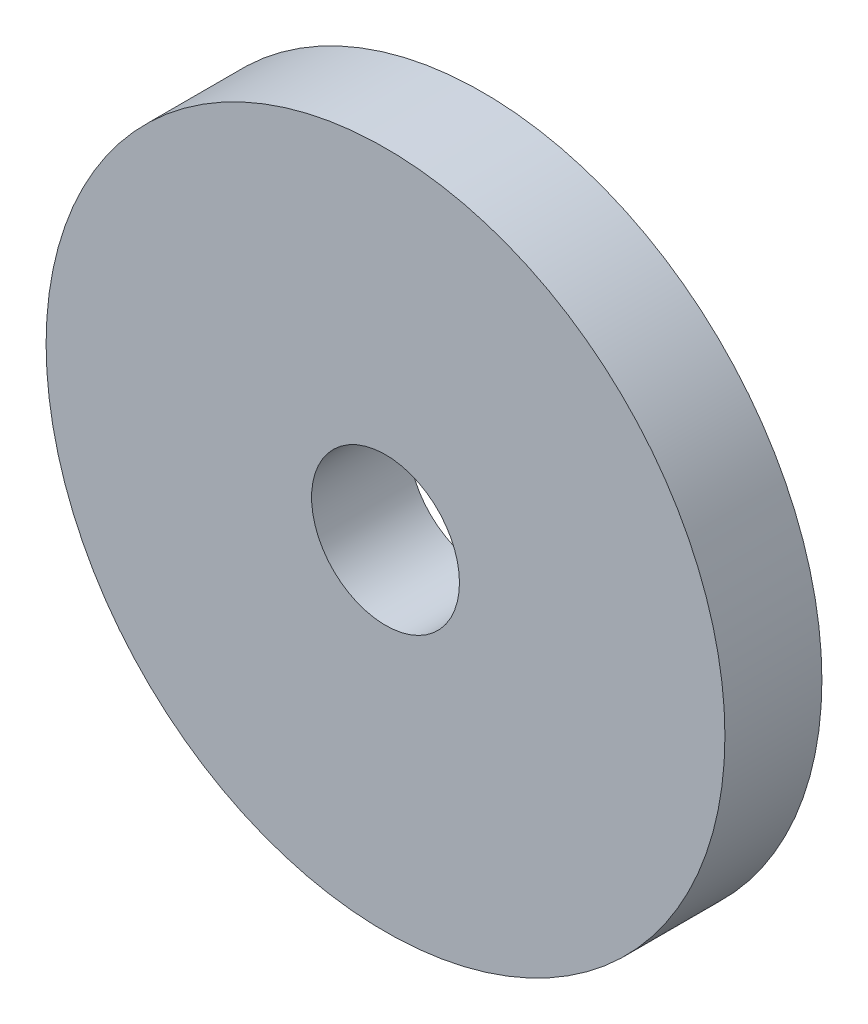
ISO-10303-21;
HEADER;
FILE_DESCRIPTION(('STEP AP214'),'2;1');
FILE_NAME('part.step','',(''),(''),'','','');
FILE_SCHEMA(('AUTOMOTIVE_DESIGN { 1 0 10303 214 1 1 1 1 }'));
ENDSEC;
DATA;
#1=APPLICATION_CONTEXT('core data for automotive mechanical design processes');
#2=APPLICATION_PROTOCOL_DEFINITION('international standard','automotive_design',2000,#1);
#3=PRODUCT_CONTEXT('',#1,'mechanical');
#4=PRODUCT('Part','Part','',(#3));
#5=PRODUCT_RELATED_PRODUCT_CATEGORY('part','',(#4));
#6=PRODUCT_DEFINITION_FORMATION('','',#4);
#7=PRODUCT_DEFINITION_CONTEXT('part definition',#1,'design');
#8=PRODUCT_DEFINITION('design','',#6,#7);
#9=PRODUCT_DEFINITION_SHAPE('','',#8);
#10=(LENGTH_UNIT() NAMED_UNIT(*) SI_UNIT(.MILLI.,.METRE.));
#11=(NAMED_UNIT(*) PLANE_ANGLE_UNIT() SI_UNIT($,.RADIAN.));
#12=(NAMED_UNIT(*) SI_UNIT($,.STERADIAN.) SOLID_ANGLE_UNIT());
#13=UNCERTAINTY_MEASURE_WITH_UNIT(LENGTH_MEASURE(1.E-05),#10,'distance_accuracy_value','');
#14=(GEOMETRIC_REPRESENTATION_CONTEXT(3) GLOBAL_UNCERTAINTY_ASSIGNED_CONTEXT((#13)) GLOBAL_UNIT_ASSIGNED_CONTEXT((#10,
#11,#12)) REPRESENTATION_CONTEXT('',''));
#15=CARTESIAN_POINT('',(0.,0.,0.));
#16=DIRECTION('',(0.,0.,1.));
#17=DIRECTION('',(1.,0.,0.));
#18=AXIS2_PLACEMENT_3D('',#15,#16,#17);
#19=CARTESIAN_POINT('',(0.,0.,2.));
#20=DIRECTION('',(0.,0.,1.));
#21=DIRECTION('',(1.,0.,0.));
#22=AXIS2_PLACEMENT_3D('',#19,#20,#21);
#23=PLANE('',#22);
#24=CARTESIAN_POINT('',(0.,0.,2.));
#25=DIRECTION('',(0.,0.,1.));
#26=DIRECTION('',(1.,0.,0.));
#27=AXIS2_PLACEMENT_3D('',#24,#25,#26);
#28=CIRCLE('',#27,7.);
#29=CARTESIAN_POINT('',(7.,0.,2.));
#30=VERTEX_POINT('',#29);
#31=EDGE_CURVE('E10',#30,#30,#28,.T.);
#32=ORIENTED_EDGE('',*,*,#31,.T.);
#33=EDGE_LOOP('',(#32));
#34=FACE_BOUND('',#33,.T.);
#35=CARTESIAN_POINT('',(0.,0.,2.));
#36=DIRECTION('',(0.,0.,1.));
#37=DIRECTION('',(1.,0.,0.));
#38=AXIS2_PLACEMENT_3D('',#35,#36,#37);
#39=CIRCLE('',#38,1.525);
#40=CARTESIAN_POINT('',(1.525,0.,2.));
#41=VERTEX_POINT('',#40);
#42=EDGE_CURVE('E44',#41,#41,#39,.T.);
#43=ORIENTED_EDGE('',*,*,#42,.F.);
#44=EDGE_LOOP('',(#43));
#45=FACE_BOUND('',#44,.T.);
#46=ADVANCED_FACE('F33',(#34,#45),#23,.T.);
#47=CARTESIAN_POINT('',(0.,0.,0.));
#48=DIRECTION('',(0.,0.,1.));
#49=DIRECTION('',(1.,0.,0.));
#50=AXIS2_PLACEMENT_3D('',#47,#48,#49);
#51=PLANE('',#50);
#52=CARTESIAN_POINT('',(0.,0.,0.));
#53=DIRECTION('',(0.,0.,1.));
#54=DIRECTION('',(1.,0.,0.));
#55=AXIS2_PLACEMENT_3D('',#52,#53,#54);
#56=CIRCLE('',#55,7.);
#57=CARTESIAN_POINT('',(7.,0.,0.));
#58=VERTEX_POINT('',#57);
#59=EDGE_CURVE('E37',#58,#58,#56,.T.);
#60=ORIENTED_EDGE('',*,*,#59,.F.);
#61=EDGE_LOOP('',(#60));
#62=FACE_BOUND('',#61,.T.);
#63=CARTESIAN_POINT('',(0.,0.,0.));
#64=DIRECTION('',(0.,0.,1.));
#65=DIRECTION('',(1.,0.,0.));
#66=AXIS2_PLACEMENT_3D('',#63,#64,#65);
#67=CIRCLE('',#66,1.525);
#68=CARTESIAN_POINT('',(1.525,0.,0.));
#69=VERTEX_POINT('',#68);
#70=EDGE_CURVE('E46',#69,#69,#67,.T.);
#71=ORIENTED_EDGE('',*,*,#70,.T.);
#72=EDGE_LOOP('',(#71));
#73=FACE_BOUND('',#72,.T.);
#74=ADVANCED_FACE('F56',(#62,#73),#51,.F.);
#75=CARTESIAN_POINT('',(0.,0.,2.));
#76=DIRECTION('',(0.,0.,-1.));
#77=DIRECTION('',(-1.,0.,0.));
#78=AXIS2_PLACEMENT_3D('',#75,#76,#77);
#79=CYLINDRICAL_SURFACE('',#78,7.);
#80=ORIENTED_EDGE('',*,*,#31,.F.);
#81=EDGE_LOOP('',(#80));
#82=FACE_BOUND('',#81,.T.);
#83=ORIENTED_EDGE('',*,*,#59,.T.);
#84=EDGE_LOOP('',(#83));
#85=FACE_BOUND('',#84,.T.);
#86=ADVANCED_FACE('F35',(#82,#85),#79,.T.);
#87=CARTESIAN_POINT('',(0.,0.,2.));
#88=DIRECTION('',(0.,0.,-1.));
#89=DIRECTION('',(-1.,0.,0.));
#90=AXIS2_PLACEMENT_3D('',#87,#88,#89);
#91=CYLINDRICAL_SURFACE('',#90,1.525);
#92=ORIENTED_EDGE('',*,*,#42,.T.);
#93=EDGE_LOOP('',(#92));
#94=FACE_BOUND('',#93,.T.);
#95=ORIENTED_EDGE('',*,*,#70,.F.);
#96=EDGE_LOOP('',(#95));
#97=FACE_BOUND('',#96,.T.);
#98=ADVANCED_FACE('F52',(#94,#97),#91,.F.);
#99=CLOSED_SHELL('',(#46,#74,#86,#98));
#100=MANIFOLD_SOLID_BREP('B2',#99);
#101=ADVANCED_BREP_SHAPE_REPRESENTATION('',(#18,#100),#14);
#102=SHAPE_DEFINITION_REPRESENTATION(#9,#101);
ENDSEC;
END-ISO-10303-21;
